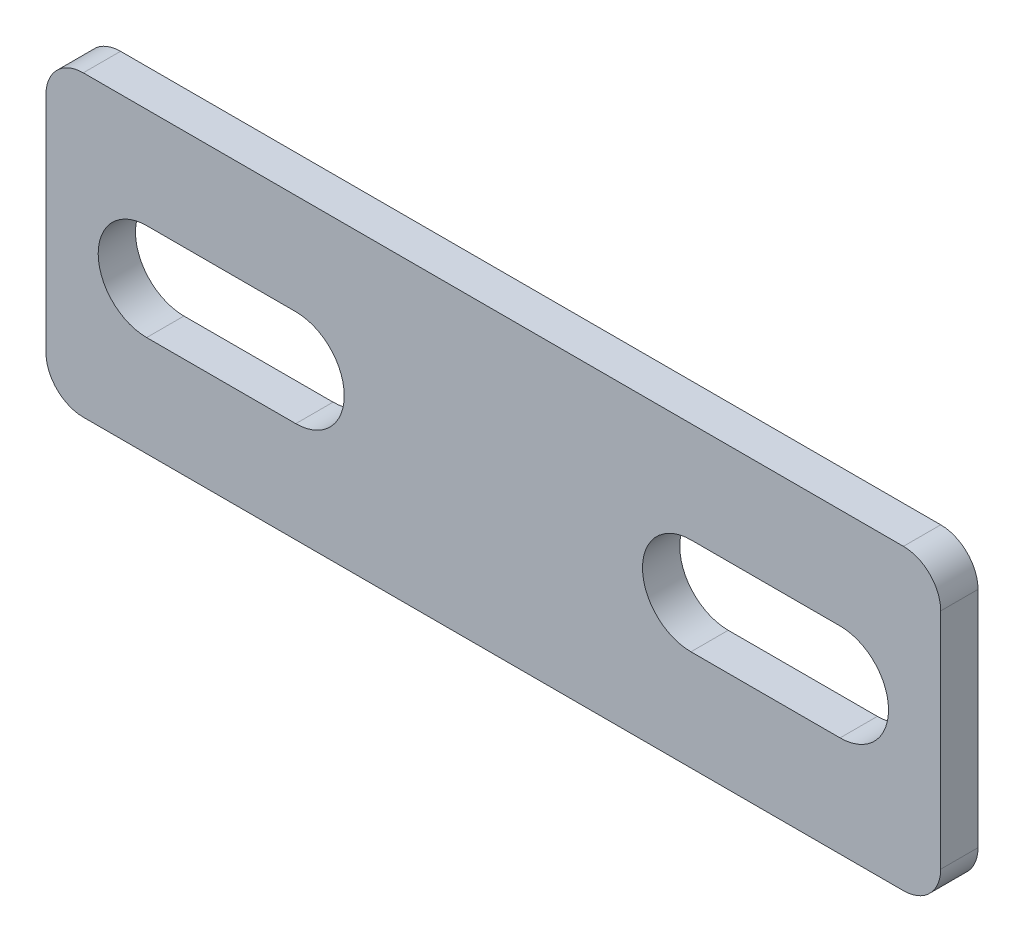
ISO-10303-21;
HEADER;
FILE_DESCRIPTION(('STEP AP214'),'2;1');
FILE_NAME('part.step','',(''),(''),'','','');
FILE_SCHEMA(('AUTOMOTIVE_DESIGN { 1 0 10303 214 1 1 1 1 }'));
ENDSEC;
DATA;
#1=APPLICATION_CONTEXT('core data for automotive mechanical design processes');
#2=APPLICATION_PROTOCOL_DEFINITION('international standard','automotive_design',2000,#1);
#3=PRODUCT_CONTEXT('',#1,'mechanical');
#4=PRODUCT('Part','Part','',(#3));
#5=PRODUCT_RELATED_PRODUCT_CATEGORY('part','',(#4));
#6=PRODUCT_DEFINITION_FORMATION('','',#4);
#7=PRODUCT_DEFINITION_CONTEXT('part definition',#1,'design');
#8=PRODUCT_DEFINITION('design','',#6,#7);
#9=PRODUCT_DEFINITION_SHAPE('','',#8);
#10=(LENGTH_UNIT() NAMED_UNIT(*) SI_UNIT(.MILLI.,.METRE.));
#11=(NAMED_UNIT(*) PLANE_ANGLE_UNIT() SI_UNIT($,.RADIAN.));
#12=(NAMED_UNIT(*) SI_UNIT($,.STERADIAN.) SOLID_ANGLE_UNIT());
#13=UNCERTAINTY_MEASURE_WITH_UNIT(LENGTH_MEASURE(1.E-05),#10,'distance_accuracy_value','');
#14=(GEOMETRIC_REPRESENTATION_CONTEXT(3) GLOBAL_UNCERTAINTY_ASSIGNED_CONTEXT((#13)) GLOBAL_UNIT_ASSIGNED_CONTEXT((#10,
#11,#12)) REPRESENTATION_CONTEXT('',''));
#15=CARTESIAN_POINT('',(0.,0.,0.));
#16=DIRECTION('',(0.,0.,1.));
#17=DIRECTION('',(1.,0.,0.));
#18=AXIS2_PLACEMENT_3D('',#15,#16,#17);
#19=CARTESIAN_POINT('',(-60.,-20.,-5.));
#20=DIRECTION('',(-1.,0.,0.));
#21=DIRECTION('',(0.,0.,1.));
#22=AXIS2_PLACEMENT_3D('',#19,#20,#21);
#23=PLANE('',#22);
#24=DIRECTION('',(0.,-1.,0.));
#25=VECTOR('',#24,1.);
#26=CARTESIAN_POINT('',(-60.,-20.,-5.));
#27=LINE('',#26,#25);
#28=CARTESIAN_POINT('',(-60.,15.,-5.));
#29=VERTEX_POINT('',#28);
#30=CARTESIAN_POINT('',(-60.,-15.,-5.));
#31=VERTEX_POINT('',#30);
#32=EDGE_CURVE('E259',#29,#31,#27,.T.);
#33=ORIENTED_EDGE('',*,*,#32,.T.);
#34=DIRECTION('',(0.,0.,1.));
#35=VECTOR('',#34,1.);
#36=CARTESIAN_POINT('',(-60.,-15.,-5.));
#37=LINE('',#36,#35);
#38=CARTESIAN_POINT('',(-60.,-15.,0.));
#39=VERTEX_POINT('',#38);
#40=EDGE_CURVE('E292',#31,#39,#37,.T.);
#41=ORIENTED_EDGE('',*,*,#40,.T.);
#42=DIRECTION('',(0.,-1.,0.));
#43=VECTOR('',#42,1.);
#44=CARTESIAN_POINT('',(-60.,-20.,0.));
#45=LINE('',#44,#43);
#46=CARTESIAN_POINT('',(-60.,15.,0.));
#47=VERTEX_POINT('',#46);
#48=EDGE_CURVE('E249',#47,#39,#45,.T.);
#49=ORIENTED_EDGE('',*,*,#48,.F.);
#50=DIRECTION('',(0.,0.,1.));
#51=VECTOR('',#50,1.);
#52=CARTESIAN_POINT('',(-60.,15.,-5.));
#53=LINE('',#52,#51);
#54=EDGE_CURVE('E275',#47,#29,#53,.F.);
#55=ORIENTED_EDGE('',*,*,#54,.T.);
#56=EDGE_LOOP('',(#33,#41,#49,#55));
#57=FACE_BOUND('',#56,.T.);
#58=ADVANCED_FACE('F43',(#57),#23,.T.);
#59=CARTESIAN_POINT('',(60.,20.,-5.));
#60=DIRECTION('',(0.,1.,0.));
#61=DIRECTION('',(-1.,0.,0.));
#62=AXIS2_PLACEMENT_3D('',#59,#60,#61);
#63=PLANE('',#62);
#64=DIRECTION('',(-1.,0.,0.));
#65=VECTOR('',#64,1.);
#66=CARTESIAN_POINT('',(60.,20.,0.));
#67=LINE('',#66,#65);
#68=CARTESIAN_POINT('',(55.,20.,0.));
#69=VERTEX_POINT('',#68);
#70=CARTESIAN_POINT('',(-55.,20.,0.));
#71=VERTEX_POINT('',#70);
#72=EDGE_CURVE('E264',#69,#71,#67,.T.);
#73=ORIENTED_EDGE('',*,*,#72,.F.);
#74=DIRECTION('',(0.,0.,1.));
#75=VECTOR('',#74,1.);
#76=CARTESIAN_POINT('',(55.,20.,-5.));
#77=LINE('',#76,#75);
#78=CARTESIAN_POINT('',(55.,20.,-5.));
#79=VERTEX_POINT('',#78);
#80=EDGE_CURVE('E12',#69,#79,#77,.F.);
#81=ORIENTED_EDGE('',*,*,#80,.T.);
#82=DIRECTION('',(-1.,0.,0.));
#83=VECTOR('',#82,1.);
#84=CARTESIAN_POINT('',(60.,20.,-5.));
#85=LINE('',#84,#83);
#86=CARTESIAN_POINT('',(-55.,20.,-5.));
#87=VERTEX_POINT('',#86);
#88=EDGE_CURVE('E270',#79,#87,#85,.T.);
#89=ORIENTED_EDGE('',*,*,#88,.T.);
#90=DIRECTION('',(0.,0.,1.));
#91=VECTOR('',#90,1.);
#92=CARTESIAN_POINT('',(-55.,20.,-5.));
#93=LINE('',#92,#91);
#94=EDGE_CURVE('E52',#87,#71,#93,.T.);
#95=ORIENTED_EDGE('',*,*,#94,.T.);
#96=EDGE_LOOP('',(#73,#81,#89,#95));
#97=FACE_BOUND('',#96,.T.);
#98=ADVANCED_FACE('F323',(#97),#63,.T.);
#99=CARTESIAN_POINT('',(60.,-20.,-5.));
#100=DIRECTION('',(1.,0.,0.));
#101=DIRECTION('',(0.,0.,-1.));
#102=AXIS2_PLACEMENT_3D('',#99,#100,#101);
#103=PLANE('',#102);
#104=DIRECTION('',(0.,1.,0.));
#105=VECTOR('',#104,1.);
#106=CARTESIAN_POINT('',(60.,-20.,0.));
#107=LINE('',#106,#105);
#108=CARTESIAN_POINT('',(60.,-15.,0.));
#109=VERTEX_POINT('',#108);
#110=CARTESIAN_POINT('',(60.,15.,0.));
#111=VERTEX_POINT('',#110);
#112=EDGE_CURVE('E283',#109,#111,#107,.T.);
#113=ORIENTED_EDGE('',*,*,#112,.F.);
#114=DIRECTION('',(0.,0.,1.));
#115=VECTOR('',#114,1.);
#116=CARTESIAN_POINT('',(60.,-15.,-5.));
#117=LINE('',#116,#115);
#118=CARTESIAN_POINT('',(60.,-15.,-5.));
#119=VERTEX_POINT('',#118);
#120=EDGE_CURVE('E66',#109,#119,#117,.F.);
#121=ORIENTED_EDGE('',*,*,#120,.T.);
#122=DIRECTION('',(0.,1.,0.));
#123=VECTOR('',#122,1.);
#124=CARTESIAN_POINT('',(60.,-20.,-5.));
#125=LINE('',#124,#123);
#126=CARTESIAN_POINT('',(60.,15.,-5.));
#127=VERTEX_POINT('',#126);
#128=EDGE_CURVE('E268',#119,#127,#125,.T.);
#129=ORIENTED_EDGE('',*,*,#128,.T.);
#130=DIRECTION('',(0.,0.,1.));
#131=VECTOR('',#130,1.);
#132=CARTESIAN_POINT('',(60.,15.,-5.));
#133=LINE('',#132,#131);
#134=EDGE_CURVE('E307',#127,#111,#133,.T.);
#135=ORIENTED_EDGE('',*,*,#134,.T.);
#136=EDGE_LOOP('',(#113,#121,#129,#135));
#137=FACE_BOUND('',#136,.T.);
#138=ADVANCED_FACE('F333',(#137),#103,.T.);
#139=CARTESIAN_POINT('',(60.,-20.,-5.));
#140=DIRECTION('',(0.,-1.,0.));
#141=DIRECTION('',(1.,0.,0.));
#142=AXIS2_PLACEMENT_3D('',#139,#140,#141);
#143=PLANE('',#142);
#144=DIRECTION('',(1.,0.,0.));
#145=VECTOR('',#144,1.);
#146=CARTESIAN_POINT('',(60.,-20.,0.));
#147=LINE('',#146,#145);
#148=CARTESIAN_POINT('',(-55.,-20.,0.));
#149=VERTEX_POINT('',#148);
#150=CARTESIAN_POINT('',(55.,-20.,0.));
#151=VERTEX_POINT('',#150);
#152=EDGE_CURVE('E279',#149,#151,#147,.T.);
#153=ORIENTED_EDGE('',*,*,#152,.F.);
#154=DIRECTION('',(0.,0.,1.));
#155=VECTOR('',#154,1.);
#156=CARTESIAN_POINT('',(-55.,-20.,-5.));
#157=LINE('',#156,#155);
#158=CARTESIAN_POINT('',(-55.,-20.,-5.));
#159=VERTEX_POINT('',#158);
#160=EDGE_CURVE('E350',#149,#159,#157,.F.);
#161=ORIENTED_EDGE('',*,*,#160,.T.);
#162=DIRECTION('',(1.,0.,0.));
#163=VECTOR('',#162,1.);
#164=CARTESIAN_POINT('',(60.,-20.,-5.));
#165=LINE('',#164,#163);
#166=CARTESIAN_POINT('',(55.,-20.,-5.));
#167=VERTEX_POINT('',#166);
#168=EDGE_CURVE('E263',#159,#167,#165,.T.);
#169=ORIENTED_EDGE('',*,*,#168,.T.);
#170=DIRECTION('',(0.,0.,1.));
#171=VECTOR('',#170,1.);
#172=CARTESIAN_POINT('',(55.,-20.,-5.));
#173=LINE('',#172,#171);
#174=EDGE_CURVE('E341',#167,#151,#173,.T.);
#175=ORIENTED_EDGE('',*,*,#174,.T.);
#176=EDGE_LOOP('',(#153,#161,#169,#175));
#177=FACE_BOUND('',#176,.T.);
#178=ADVANCED_FACE('F361',(#177),#143,.T.);
#179=CARTESIAN_POINT('',(0.,0.,-5.));
#180=DIRECTION('',(0.,0.,1.));
#181=DIRECTION('',(1.,0.,0.));
#182=AXIS2_PLACEMENT_3D('',#179,#180,#181);
#183=PLANE('',#182);
#184=DIRECTION('',(1.,0.,0.));
#185=VECTOR('',#184,1.);
#186=CARTESIAN_POINT('',(46.5,-6.49999999999997,-5.));
#187=LINE('',#186,#185);
#188=CARTESIAN_POINT('',(26.5,-6.49999999999996,-5.));
#189=VERTEX_POINT('',#188);
#190=CARTESIAN_POINT('',(46.5,-6.49999999999997,-5.));
#191=VERTEX_POINT('',#190);
#192=EDGE_CURVE('E171',#189,#191,#187,.T.);
#193=ORIENTED_EDGE('',*,*,#192,.T.);
#194=CARTESIAN_POINT('',(46.5,0.,-5.));
#195=DIRECTION('',(0.,0.,1.));
#196=DIRECTION('',(-1.,0.,0.));
#197=AXIS2_PLACEMENT_3D('',#194,#195,#196);
#198=CIRCLE('',#197,6.49999999999997);
#199=CARTESIAN_POINT('',(46.5,6.49999999999996,-5.));
#200=VERTEX_POINT('',#199);
#201=EDGE_CURVE('E162',#191,#200,#198,.T.);
#202=ORIENTED_EDGE('',*,*,#201,.T.);
#203=DIRECTION('',(-1.,0.,0.));
#204=VECTOR('',#203,1.);
#205=CARTESIAN_POINT('',(46.5,6.49999999999996,-5.));
#206=LINE('',#205,#204);
#207=CARTESIAN_POINT('',(26.5,6.49999999999996,-5.));
#208=VERTEX_POINT('',#207);
#209=EDGE_CURVE('E175',#200,#208,#206,.T.);
#210=ORIENTED_EDGE('',*,*,#209,.T.);
#211=CARTESIAN_POINT('',(26.5,0.,-5.));
#212=DIRECTION('',(0.,0.,1.));
#213=DIRECTION('',(-1.,0.,0.));
#214=AXIS2_PLACEMENT_3D('',#211,#212,#213);
#215=CIRCLE('',#214,6.49999999999997);
#216=EDGE_CURVE('E180',#208,#189,#215,.T.);
#217=ORIENTED_EDGE('',*,*,#216,.T.);
#218=EDGE_LOOP('',(#193,#202,#210,#217));
#219=FACE_BOUND('',#218,.T.);
#220=DIRECTION('',(-1.,0.,0.));
#221=VECTOR('',#220,1.);
#222=CARTESIAN_POINT('',(-46.5,6.49999999999996,-5.));
#223=LINE('',#222,#221);
#224=CARTESIAN_POINT('',(-26.5,6.49999999999996,-5.));
#225=VERTEX_POINT('',#224);
#226=CARTESIAN_POINT('',(-46.5,6.49999999999996,-5.));
#227=VERTEX_POINT('',#226);
#228=EDGE_CURVE('E228',#225,#227,#223,.T.);
#229=ORIENTED_EDGE('',*,*,#228,.T.);
#230=CARTESIAN_POINT('',(-46.5,0.,-5.));
#231=DIRECTION('',(0.,0.,1.));
#232=DIRECTION('',(1.,0.,0.));
#233=AXIS2_PLACEMENT_3D('',#230,#231,#232);
#234=CIRCLE('',#233,6.49999999999997);
#235=CARTESIAN_POINT('',(-46.5,-6.49999999999998,-5.));
#236=VERTEX_POINT('',#235);
#237=EDGE_CURVE('E215',#227,#236,#234,.T.);
#238=ORIENTED_EDGE('',*,*,#237,.T.);
#239=DIRECTION('',(1.,0.,0.));
#240=VECTOR('',#239,1.);
#241=CARTESIAN_POINT('',(-46.5,-6.49999999999998,-5.));
#242=LINE('',#241,#240);
#243=CARTESIAN_POINT('',(-26.5,-6.49999999999997,-5.));
#244=VERTEX_POINT('',#243);
#245=EDGE_CURVE('E219',#236,#244,#242,.T.);
#246=ORIENTED_EDGE('',*,*,#245,.T.);
#247=CARTESIAN_POINT('',(-26.5,0.,-5.));
#248=DIRECTION('',(0.,0.,1.));
#249=DIRECTION('',(1.,0.,0.));
#250=AXIS2_PLACEMENT_3D('',#247,#248,#249);
#251=CIRCLE('',#250,6.49999999999997);
#252=EDGE_CURVE('E224',#244,#225,#251,.T.);
#253=ORIENTED_EDGE('',*,*,#252,.T.);
#254=EDGE_LOOP('',(#229,#238,#246,#253));
#255=FACE_BOUND('',#254,.T.);
#256=ORIENTED_EDGE('',*,*,#168,.F.);
#257=CARTESIAN_POINT('',(-55.,-15.,-5.));
#258=DIRECTION('',(0.,0.,1.));
#259=DIRECTION('',(1.,0.,0.));
#260=AXIS2_PLACEMENT_3D('',#257,#258,#259);
#261=CIRCLE('',#260,5.);
#262=EDGE_CURVE('E313',#159,#31,#261,.F.);
#263=ORIENTED_EDGE('',*,*,#262,.T.);
#264=ORIENTED_EDGE('',*,*,#32,.F.);
#265=CARTESIAN_POINT('',(-55.,15.,-5.));
#266=DIRECTION('',(0.,0.,1.));
#267=DIRECTION('',(1.,0.,0.));
#268=AXIS2_PLACEMENT_3D('',#265,#266,#267);
#269=CIRCLE('',#268,5.);
#270=EDGE_CURVE('E345',#29,#87,#269,.F.);
#271=ORIENTED_EDGE('',*,*,#270,.T.);
#272=ORIENTED_EDGE('',*,*,#88,.F.);
#273=CARTESIAN_POINT('',(55.,15.,-5.));
#274=DIRECTION('',(0.,0.,1.));
#275=DIRECTION('',(1.,0.,0.));
#276=AXIS2_PLACEMENT_3D('',#273,#274,#275);
#277=CIRCLE('',#276,5.);
#278=EDGE_CURVE('E59',#79,#127,#277,.F.);
#279=ORIENTED_EDGE('',*,*,#278,.T.);
#280=ORIENTED_EDGE('',*,*,#128,.F.);
#281=CARTESIAN_POINT('',(55.,-15.,-5.));
#282=DIRECTION('',(0.,0.,1.));
#283=DIRECTION('',(1.,0.,0.));
#284=AXIS2_PLACEMENT_3D('',#281,#282,#283);
#285=CIRCLE('',#284,5.);
#286=EDGE_CURVE('E336',#119,#167,#285,.F.);
#287=ORIENTED_EDGE('',*,*,#286,.T.);
#288=EDGE_LOOP('',(#256,#263,#264,#271,#272,#279,#280,#287));
#289=FACE_BOUND('',#288,.T.);
#290=ADVANCED_FACE('F182',(#219,#255,#289),#183,.F.);
#291=CARTESIAN_POINT('',(0.,0.,0.));
#292=DIRECTION('',(0.,0.,1.));
#293=DIRECTION('',(1.,0.,0.));
#294=AXIS2_PLACEMENT_3D('',#291,#292,#293);
#295=PLANE('',#294);
#296=CARTESIAN_POINT('',(46.5,0.,0.));
#297=DIRECTION('',(0.,0.,1.));
#298=DIRECTION('',(-1.,0.,0.));
#299=AXIS2_PLACEMENT_3D('',#296,#297,#298);
#300=CIRCLE('',#299,6.49999999999997);
#301=CARTESIAN_POINT('',(46.5,-6.49999999999997,0.));
#302=VERTEX_POINT('',#301);
#303=CARTESIAN_POINT('',(46.5,6.49999999999996,0.));
#304=VERTEX_POINT('',#303);
#305=EDGE_CURVE('E165',#302,#304,#300,.T.);
#306=ORIENTED_EDGE('',*,*,#305,.F.);
#307=DIRECTION('',(1.,0.,0.));
#308=VECTOR('',#307,1.);
#309=CARTESIAN_POINT('',(46.5,-6.49999999999997,0.));
#310=LINE('',#309,#308);
#311=CARTESIAN_POINT('',(26.5,-6.49999999999996,0.));
#312=VERTEX_POINT('',#311);
#313=EDGE_CURVE('E186',#312,#302,#310,.T.);
#314=ORIENTED_EDGE('',*,*,#313,.F.);
#315=CARTESIAN_POINT('',(26.5,0.,0.));
#316=DIRECTION('',(0.,0.,1.));
#317=DIRECTION('',(-1.,0.,0.));
#318=AXIS2_PLACEMENT_3D('',#315,#316,#317);
#319=CIRCLE('',#318,6.49999999999997);
#320=CARTESIAN_POINT('',(26.5,6.49999999999996,0.));
#321=VERTEX_POINT('',#320);
#322=EDGE_CURVE('E191',#321,#312,#319,.T.);
#323=ORIENTED_EDGE('',*,*,#322,.F.);
#324=DIRECTION('',(-1.,0.,0.));
#325=VECTOR('',#324,1.);
#326=CARTESIAN_POINT('',(46.5,6.49999999999996,0.));
#327=LINE('',#326,#325);
#328=EDGE_CURVE('E200',#304,#321,#327,.T.);
#329=ORIENTED_EDGE('',*,*,#328,.F.);
#330=EDGE_LOOP('',(#306,#314,#323,#329));
#331=FACE_BOUND('',#330,.T.);
#332=CARTESIAN_POINT('',(-46.5,0.,0.));
#333=DIRECTION('',(0.,0.,1.));
#334=DIRECTION('',(1.,0.,0.));
#335=AXIS2_PLACEMENT_3D('',#332,#333,#334);
#336=CIRCLE('',#335,6.49999999999997);
#337=CARTESIAN_POINT('',(-46.5,6.49999999999996,0.));
#338=VERTEX_POINT('',#337);
#339=CARTESIAN_POINT('',(-46.5,-6.49999999999998,0.));
#340=VERTEX_POINT('',#339);
#341=EDGE_CURVE('E209',#338,#340,#336,.T.);
#342=ORIENTED_EDGE('',*,*,#341,.F.);
#343=DIRECTION('',(-1.,0.,0.));
#344=VECTOR('',#343,1.);
#345=CARTESIAN_POINT('',(-46.5,6.49999999999996,0.));
#346=LINE('',#345,#344);
#347=CARTESIAN_POINT('',(-26.5,6.49999999999996,0.));
#348=VERTEX_POINT('',#347);
#349=EDGE_CURVE('E220',#348,#338,#346,.T.);
#350=ORIENTED_EDGE('',*,*,#349,.F.);
#351=CARTESIAN_POINT('',(-26.5,0.,0.));
#352=DIRECTION('',(0.,0.,1.));
#353=DIRECTION('',(1.,0.,0.));
#354=AXIS2_PLACEMENT_3D('',#351,#352,#353);
#355=CIRCLE('',#354,6.49999999999997);
#356=CARTESIAN_POINT('',(-26.5,-6.49999999999997,0.));
#357=VERTEX_POINT('',#356);
#358=EDGE_CURVE('E239',#357,#348,#355,.T.);
#359=ORIENTED_EDGE('',*,*,#358,.F.);
#360=DIRECTION('',(1.,0.,0.));
#361=VECTOR('',#360,1.);
#362=CARTESIAN_POINT('',(-46.5,-6.49999999999998,0.));
#363=LINE('',#362,#361);
#364=EDGE_CURVE('E235',#340,#357,#363,.T.);
#365=ORIENTED_EDGE('',*,*,#364,.F.);
#366=EDGE_LOOP('',(#342,#350,#359,#365));
#367=FACE_BOUND('',#366,.T.);
#368=ORIENTED_EDGE('',*,*,#48,.T.);
#369=CARTESIAN_POINT('',(-55.,-15.,0.));
#370=DIRECTION('',(0.,0.,1.));
#371=DIRECTION('',(1.,0.,0.));
#372=AXIS2_PLACEMENT_3D('',#369,#370,#371);
#373=CIRCLE('',#372,5.);
#374=EDGE_CURVE('E354',#39,#149,#373,.T.);
#375=ORIENTED_EDGE('',*,*,#374,.T.);
#376=ORIENTED_EDGE('',*,*,#152,.T.);
#377=CARTESIAN_POINT('',(55.,-15.,0.));
#378=DIRECTION('',(0.,0.,1.));
#379=DIRECTION('',(1.,0.,0.));
#380=AXIS2_PLACEMENT_3D('',#377,#378,#379);
#381=CIRCLE('',#380,5.);
#382=EDGE_CURVE('E303',#151,#109,#381,.T.);
#383=ORIENTED_EDGE('',*,*,#382,.T.);
#384=ORIENTED_EDGE('',*,*,#112,.T.);
#385=CARTESIAN_POINT('',(55.,15.,0.));
#386=DIRECTION('',(0.,0.,1.));
#387=DIRECTION('',(1.,0.,0.));
#388=AXIS2_PLACEMENT_3D('',#385,#386,#387);
#389=CIRCLE('',#388,5.);
#390=EDGE_CURVE('E299',#111,#69,#389,.T.);
#391=ORIENTED_EDGE('',*,*,#390,.T.);
#392=ORIENTED_EDGE('',*,*,#72,.T.);
#393=CARTESIAN_POINT('',(-55.,15.,0.));
#394=DIRECTION('',(0.,0.,1.));
#395=DIRECTION('',(1.,0.,0.));
#396=AXIS2_PLACEMENT_3D('',#393,#394,#395);
#397=CIRCLE('',#396,5.);
#398=EDGE_CURVE('E296',#71,#47,#397,.T.);
#399=ORIENTED_EDGE('',*,*,#398,.T.);
#400=EDGE_LOOP('',(#368,#375,#376,#383,#384,#391,#392,#399));
#401=FACE_BOUND('',#400,.T.);
#402=ADVANCED_FACE('F328',(#331,#367,#401),#295,.T.);
#403=CARTESIAN_POINT('',(-46.5,0.,-5.));
#404=DIRECTION('',(0.,0.,1.));
#405=DIRECTION('',(1.,0.,0.));
#406=AXIS2_PLACEMENT_3D('',#403,#404,#405);
#407=CYLINDRICAL_SURFACE('',#406,6.49999999999997);
#408=ORIENTED_EDGE('',*,*,#341,.T.);
#409=DIRECTION('',(0.,0.,1.));
#410=VECTOR('',#409,1.);
#411=CARTESIAN_POINT('',(-46.5,-6.49999999999998,-5.));
#412=LINE('',#411,#410);
#413=EDGE_CURVE('E232',#236,#340,#412,.T.);
#414=ORIENTED_EDGE('',*,*,#413,.F.);
#415=ORIENTED_EDGE('',*,*,#237,.F.);
#416=DIRECTION('',(0.,0.,1.));
#417=VECTOR('',#416,1.);
#418=CARTESIAN_POINT('',(-46.5,6.49999999999996,-5.));
#419=LINE('',#418,#417);
#420=EDGE_CURVE('E246',#227,#338,#419,.T.);
#421=ORIENTED_EDGE('',*,*,#420,.T.);
#422=EDGE_LOOP('',(#408,#414,#415,#421));
#423=FACE_BOUND('',#422,.T.);
#424=ADVANCED_FACE('F496',(#423),#407,.F.);
#425=CARTESIAN_POINT('',(-46.5,6.49999999999996,-5.));
#426=DIRECTION('',(0.,1.,0.));
#427=DIRECTION('',(0.,0.,1.));
#428=AXIS2_PLACEMENT_3D('',#425,#426,#427);
#429=PLANE('',#428);
#430=ORIENTED_EDGE('',*,*,#349,.T.);
#431=ORIENTED_EDGE('',*,*,#420,.F.);
#432=ORIENTED_EDGE('',*,*,#228,.F.);
#433=DIRECTION('',(0.,0.,1.));
#434=VECTOR('',#433,1.);
#435=CARTESIAN_POINT('',(-26.5,6.49999999999996,-5.));
#436=LINE('',#435,#434);
#437=EDGE_CURVE('E250',#225,#348,#436,.T.);
#438=ORIENTED_EDGE('',*,*,#437,.T.);
#439=EDGE_LOOP('',(#430,#431,#432,#438));
#440=FACE_BOUND('',#439,.T.);
#441=ADVANCED_FACE('F485',(#440),#429,.F.);
#442=CARTESIAN_POINT('',(-26.5,0.,-5.));
#443=DIRECTION('',(0.,0.,1.));
#444=DIRECTION('',(1.,0.,0.));
#445=AXIS2_PLACEMENT_3D('',#442,#443,#444);
#446=CYLINDRICAL_SURFACE('',#445,6.49999999999997);
#447=ORIENTED_EDGE('',*,*,#358,.T.);
#448=ORIENTED_EDGE('',*,*,#437,.F.);
#449=ORIENTED_EDGE('',*,*,#252,.F.);
#450=DIRECTION('',(0.,0.,1.));
#451=VECTOR('',#450,1.);
#452=CARTESIAN_POINT('',(-26.5,-6.49999999999997,-5.));
#453=LINE('',#452,#451);
#454=EDGE_CURVE('E253',#244,#357,#453,.T.);
#455=ORIENTED_EDGE('',*,*,#454,.T.);
#456=EDGE_LOOP('',(#447,#448,#449,#455));
#457=FACE_BOUND('',#456,.T.);
#458=ADVANCED_FACE('F474',(#457),#446,.F.);
#459=CARTESIAN_POINT('',(-46.5,-6.49999999999998,-5.));
#460=DIRECTION('',(0.,-1.,0.));
#461=DIRECTION('',(1.,0.,0.));
#462=AXIS2_PLACEMENT_3D('',#459,#460,#461);
#463=PLANE('',#462);
#464=ORIENTED_EDGE('',*,*,#364,.T.);
#465=ORIENTED_EDGE('',*,*,#454,.F.);
#466=ORIENTED_EDGE('',*,*,#245,.F.);
#467=ORIENTED_EDGE('',*,*,#413,.T.);
#468=EDGE_LOOP('',(#464,#465,#466,#467));
#469=FACE_BOUND('',#468,.T.);
#470=ADVANCED_FACE('F464',(#469),#463,.F.);
#471=CARTESIAN_POINT('',(46.5,0.,-5.));
#472=DIRECTION('',(0.,0.,1.));
#473=DIRECTION('',(1.,0.,0.));
#474=AXIS2_PLACEMENT_3D('',#471,#472,#473);
#475=CYLINDRICAL_SURFACE('',#474,6.49999999999997);
#476=ORIENTED_EDGE('',*,*,#305,.T.);
#477=DIRECTION('',(0.,0.,1.));
#478=VECTOR('',#477,1.);
#479=CARTESIAN_POINT('',(46.5,6.49999999999996,-5.));
#480=LINE('',#479,#478);
#481=EDGE_CURVE('E158',#200,#304,#480,.T.);
#482=ORIENTED_EDGE('',*,*,#481,.F.);
#483=ORIENTED_EDGE('',*,*,#201,.F.);
#484=DIRECTION('',(0.,0.,1.));
#485=VECTOR('',#484,1.);
#486=CARTESIAN_POINT('',(46.5,-6.49999999999997,-5.));
#487=LINE('',#486,#485);
#488=EDGE_CURVE('E206',#191,#302,#487,.T.);
#489=ORIENTED_EDGE('',*,*,#488,.T.);
#490=EDGE_LOOP('',(#476,#482,#483,#489));
#491=FACE_BOUND('',#490,.T.);
#492=ADVANCED_FACE('F160',(#491),#475,.F.);
#493=CARTESIAN_POINT('',(46.5,-6.49999999999997,-5.));
#494=DIRECTION('',(0.,-1.,0.));
#495=DIRECTION('',(1.,0.,0.));
#496=AXIS2_PLACEMENT_3D('',#493,#494,#495);
#497=PLANE('',#496);
#498=ORIENTED_EDGE('',*,*,#313,.T.);
#499=ORIENTED_EDGE('',*,*,#488,.F.);
#500=ORIENTED_EDGE('',*,*,#192,.F.);
#501=DIRECTION('',(0.,0.,1.));
#502=VECTOR('',#501,1.);
#503=CARTESIAN_POINT('',(26.5,-6.49999999999996,-5.));
#504=LINE('',#503,#502);
#505=EDGE_CURVE('E210',#189,#312,#504,.T.);
#506=ORIENTED_EDGE('',*,*,#505,.T.);
#507=EDGE_LOOP('',(#498,#499,#500,#506));
#508=FACE_BOUND('',#507,.T.);
#509=ADVANCED_FACE('F443',(#508),#497,.F.);
#510=CARTESIAN_POINT('',(26.5,0.,-5.));
#511=DIRECTION('',(0.,0.,1.));
#512=DIRECTION('',(1.,0.,0.));
#513=AXIS2_PLACEMENT_3D('',#510,#511,#512);
#514=CYLINDRICAL_SURFACE('',#513,6.49999999999997);
#515=ORIENTED_EDGE('',*,*,#322,.T.);
#516=ORIENTED_EDGE('',*,*,#505,.F.);
#517=ORIENTED_EDGE('',*,*,#216,.F.);
#518=DIRECTION('',(0.,0.,1.));
#519=VECTOR('',#518,1.);
#520=CARTESIAN_POINT('',(26.5,6.49999999999996,-5.));
#521=LINE('',#520,#519);
#522=EDGE_CURVE('E170',#208,#321,#521,.T.);
#523=ORIENTED_EDGE('',*,*,#522,.T.);
#524=EDGE_LOOP('',(#515,#516,#517,#523));
#525=FACE_BOUND('',#524,.T.);
#526=ADVANCED_FACE('F433',(#525),#514,.F.);
#527=CARTESIAN_POINT('',(46.5,6.49999999999996,-5.));
#528=DIRECTION('',(0.,1.,0.));
#529=DIRECTION('',(0.,0.,1.));
#530=AXIS2_PLACEMENT_3D('',#527,#528,#529);
#531=PLANE('',#530);
#532=ORIENTED_EDGE('',*,*,#328,.T.);
#533=ORIENTED_EDGE('',*,*,#522,.F.);
#534=ORIENTED_EDGE('',*,*,#209,.F.);
#535=ORIENTED_EDGE('',*,*,#481,.T.);
#536=EDGE_LOOP('',(#532,#533,#534,#535));
#537=FACE_BOUND('',#536,.T.);
#538=ADVANCED_FACE('F176',(#537),#531,.F.);
#539=CARTESIAN_POINT('',(-55.,-15.,-5.));
#540=DIRECTION('',(0.,0.,1.));
#541=DIRECTION('',(1.,0.,0.));
#542=AXIS2_PLACEMENT_3D('',#539,#540,#541);
#543=CYLINDRICAL_SURFACE('',#542,5.);
#544=ORIENTED_EDGE('',*,*,#262,.F.);
#545=ORIENTED_EDGE('',*,*,#160,.F.);
#546=ORIENTED_EDGE('',*,*,#374,.F.);
#547=ORIENTED_EDGE('',*,*,#40,.F.);
#548=EDGE_LOOP('',(#544,#545,#546,#547));
#549=FACE_BOUND('',#548,.T.);
#550=ADVANCED_FACE('F367',(#549),#543,.T.);
#551=CARTESIAN_POINT('',(55.,-15.,-5.));
#552=DIRECTION('',(0.,0.,1.));
#553=DIRECTION('',(1.,0.,0.));
#554=AXIS2_PLACEMENT_3D('',#551,#552,#553);
#555=CYLINDRICAL_SURFACE('',#554,5.);
#556=ORIENTED_EDGE('',*,*,#286,.F.);
#557=ORIENTED_EDGE('',*,*,#120,.F.);
#558=ORIENTED_EDGE('',*,*,#382,.F.);
#559=ORIENTED_EDGE('',*,*,#174,.F.);
#560=EDGE_LOOP('',(#556,#557,#558,#559));
#561=FACE_BOUND('',#560,.T.);
#562=ADVANCED_FACE('F339',(#561),#555,.T.);
#563=CARTESIAN_POINT('',(55.,15.,-5.));
#564=DIRECTION('',(0.,0.,1.));
#565=DIRECTION('',(1.,0.,0.));
#566=AXIS2_PLACEMENT_3D('',#563,#564,#565);
#567=CYLINDRICAL_SURFACE('',#566,5.);
#568=ORIENTED_EDGE('',*,*,#278,.F.);
#569=ORIENTED_EDGE('',*,*,#80,.F.);
#570=ORIENTED_EDGE('',*,*,#390,.F.);
#571=ORIENTED_EDGE('',*,*,#134,.F.);
#572=EDGE_LOOP('',(#568,#569,#570,#571));
#573=FACE_BOUND('',#572,.T.);
#574=ADVANCED_FACE('F332',(#573),#567,.T.);
#575=CARTESIAN_POINT('',(-55.,15.,-5.));
#576=DIRECTION('',(0.,0.,1.));
#577=DIRECTION('',(1.,0.,0.));
#578=AXIS2_PLACEMENT_3D('',#575,#576,#577);
#579=CYLINDRICAL_SURFACE('',#578,5.);
#580=ORIENTED_EDGE('',*,*,#270,.F.);
#581=ORIENTED_EDGE('',*,*,#54,.F.);
#582=ORIENTED_EDGE('',*,*,#398,.F.);
#583=ORIENTED_EDGE('',*,*,#94,.F.);
#584=EDGE_LOOP('',(#580,#581,#582,#583));
#585=FACE_BOUND('',#584,.T.);
#586=ADVANCED_FACE('F45',(#585),#579,.T.);
#587=CLOSED_SHELL('',(#58,#98,#138,#178,#290,#402,#424,#441,#458,#470,#492,#509,#526,#538,#550,
#562,#574,#586));
#588=MANIFOLD_SOLID_BREP('B2',#587);
#589=ADVANCED_BREP_SHAPE_REPRESENTATION('',(#18,#588),#14);
#590=SHAPE_DEFINITION_REPRESENTATION(#9,#589);
ENDSEC;
END-ISO-10303-21;
